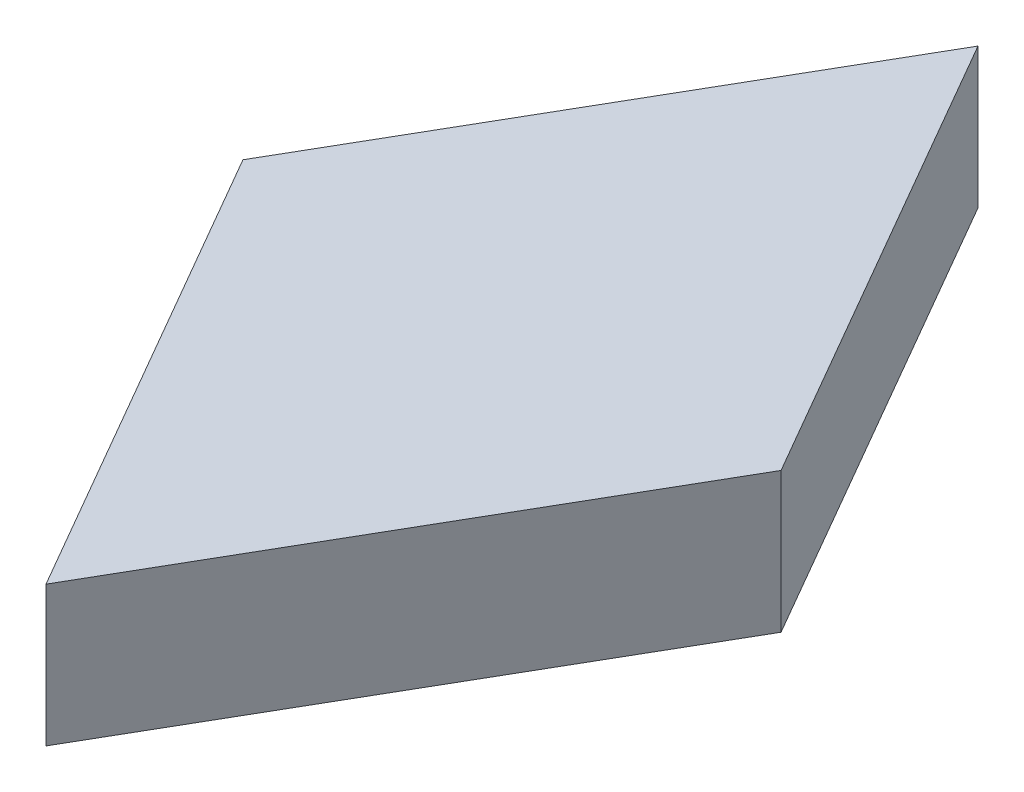
ISO-10303-21;
HEADER;
FILE_DESCRIPTION(('STEP AP214'),'2;1');
FILE_NAME('part.step','',(''),(''),'','','');
FILE_SCHEMA(('AUTOMOTIVE_DESIGN { 1 0 10303 214 1 1 1 1 }'));
ENDSEC;
DATA;
#1=APPLICATION_CONTEXT('core data for automotive mechanical design processes');
#2=APPLICATION_PROTOCOL_DEFINITION('international standard','automotive_design',2000,#1);
#3=PRODUCT_CONTEXT('',#1,'mechanical');
#4=PRODUCT('Part','Part','',(#3));
#5=PRODUCT_RELATED_PRODUCT_CATEGORY('part','',(#4));
#6=PRODUCT_DEFINITION_FORMATION('','',#4);
#7=PRODUCT_DEFINITION_CONTEXT('part definition',#1,'design');
#8=PRODUCT_DEFINITION('design','',#6,#7);
#9=PRODUCT_DEFINITION_SHAPE('','',#8);
#10=(LENGTH_UNIT() NAMED_UNIT(*) SI_UNIT(.MILLI.,.METRE.));
#11=(NAMED_UNIT(*) PLANE_ANGLE_UNIT() SI_UNIT($,.RADIAN.));
#12=(NAMED_UNIT(*) SI_UNIT($,.STERADIAN.) SOLID_ANGLE_UNIT());
#13=UNCERTAINTY_MEASURE_WITH_UNIT(LENGTH_MEASURE(1.E-05),#10,'distance_accuracy_value','');
#14=(GEOMETRIC_REPRESENTATION_CONTEXT(3) GLOBAL_UNCERTAINTY_ASSIGNED_CONTEXT((#13)) GLOBAL_UNIT_ASSIGNED_CONTEXT((#10,
#11,#12)) REPRESENTATION_CONTEXT('',''));
#15=CARTESIAN_POINT('',(0.,0.,0.));
#16=DIRECTION('',(0.,0.,1.));
#17=DIRECTION('',(1.,0.,0.));
#18=AXIS2_PLACEMENT_3D('',#15,#16,#17);
#19=CARTESIAN_POINT('',(0.,2.,6.65107510106452));
#20=DIRECTION('',(-0.866025403784438,0.,-0.5));
#21=DIRECTION('',(-0.5,0.,0.866025403784438));
#22=AXIS2_PLACEMENT_3D('',#19,#20,#21);
#23=PLANE('',#22);
#24=DIRECTION('',(0.5,0.,-0.866025403784438));
#25=VECTOR('',#24,1.);
#26=CARTESIAN_POINT('',(0.,0.,6.65107510106452));
#27=LINE('',#26,#25);
#28=CARTESIAN_POINT('',(0.,0.,6.65107510106452));
#29=VERTEX_POINT('',#28);
#30=CARTESIAN_POINT('',(3.83999999999999,0.,0.));
#31=VERTEX_POINT('',#30);
#32=EDGE_CURVE('E107',#29,#31,#27,.T.);
#33=ORIENTED_EDGE('',*,*,#32,.T.);
#34=DIRECTION('',(0.,-1.,0.));
#35=VECTOR('',#34,1.);
#36=CARTESIAN_POINT('',(3.83999999999999,2.,0.));
#37=LINE('',#36,#35);
#38=CARTESIAN_POINT('',(3.83999999999999,2.,0.));
#39=VERTEX_POINT('',#38);
#40=EDGE_CURVE('E11',#39,#31,#37,.T.);
#41=ORIENTED_EDGE('',*,*,#40,.F.);
#42=DIRECTION('',(0.5,0.,-0.866025403784438));
#43=VECTOR('',#42,1.);
#44=CARTESIAN_POINT('',(0.,2.,6.65107510106452));
#45=LINE('',#44,#43);
#46=CARTESIAN_POINT('',(0.,2.,6.65107510106452));
#47=VERTEX_POINT('',#46);
#48=EDGE_CURVE('E92',#47,#39,#45,.T.);
#49=ORIENTED_EDGE('',*,*,#48,.F.);
#50=DIRECTION('',(0.,-1.,0.));
#51=VECTOR('',#50,1.);
#52=CARTESIAN_POINT('',(0.,2.,6.65107510106452));
#53=LINE('',#52,#51);
#54=EDGE_CURVE('E103',#47,#29,#53,.T.);
#55=ORIENTED_EDGE('',*,*,#54,.T.);
#56=EDGE_LOOP('',(#33,#41,#49,#55));
#57=FACE_BOUND('',#56,.T.);
#58=ADVANCED_FACE('F40',(#57),#23,.F.);
#59=CARTESIAN_POINT('',(3.83999999999999,2.,0.));
#60=DIRECTION('',(-0.866025403784438,0.,0.500000000000001));
#61=DIRECTION('',(0.500000000000001,0.,0.866025403784438));
#62=AXIS2_PLACEMENT_3D('',#59,#60,#61);
#63=PLANE('',#62);
#64=DIRECTION('',(-0.500000000000001,0.,-0.866025403784438));
#65=VECTOR('',#64,1.);
#66=CARTESIAN_POINT('',(3.83999999999999,0.,0.));
#67=LINE('',#66,#65);
#68=CARTESIAN_POINT('',(0.,0.,-6.65107510106452));
#69=VERTEX_POINT('',#68);
#70=EDGE_CURVE('E97',#31,#69,#67,.T.);
#71=ORIENTED_EDGE('',*,*,#70,.T.);
#72=DIRECTION('',(0.,-1.,0.));
#73=VECTOR('',#72,1.);
#74=CARTESIAN_POINT('',(0.,2.,-6.65107510106452));
#75=LINE('',#74,#73);
#76=CARTESIAN_POINT('',(0.,2.,-6.65107510106452));
#77=VERTEX_POINT('',#76);
#78=EDGE_CURVE('E48',#77,#69,#75,.T.);
#79=ORIENTED_EDGE('',*,*,#78,.F.);
#80=DIRECTION('',(-0.500000000000001,0.,-0.866025403784438));
#81=VECTOR('',#80,1.);
#82=CARTESIAN_POINT('',(3.83999999999999,2.,0.));
#83=LINE('',#82,#81);
#84=EDGE_CURVE('E86',#39,#77,#83,.T.);
#85=ORIENTED_EDGE('',*,*,#84,.F.);
#86=ORIENTED_EDGE('',*,*,#40,.T.);
#87=EDGE_LOOP('',(#71,#79,#85,#86));
#88=FACE_BOUND('',#87,.T.);
#89=ADVANCED_FACE('F96',(#88),#63,.F.);
#90=CARTESIAN_POINT('',(0.,2.,-6.65107510106452));
#91=DIRECTION('',(0.866025403784442,0.,0.499999999999995));
#92=DIRECTION('',(0.499999999999995,0.,-0.866025403784442));
#93=AXIS2_PLACEMENT_3D('',#90,#91,#92);
#94=PLANE('',#93);
#95=DIRECTION('',(-0.499999999999995,0.,0.866025403784442));
#96=VECTOR('',#95,1.);
#97=CARTESIAN_POINT('',(0.,0.,-6.65107510106452));
#98=LINE('',#97,#96);
#99=CARTESIAN_POINT('',(-3.83999999999999,0.,0.));
#100=VERTEX_POINT('',#99);
#101=EDGE_CURVE('E73',#69,#100,#98,.T.);
#102=ORIENTED_EDGE('',*,*,#101,.T.);
#103=DIRECTION('',(0.,-1.,0.));
#104=VECTOR('',#103,1.);
#105=CARTESIAN_POINT('',(-3.83999999999999,2.,0.));
#106=LINE('',#105,#104);
#107=CARTESIAN_POINT('',(-3.83999999999999,2.,0.));
#108=VERTEX_POINT('',#107);
#109=EDGE_CURVE('E99',#108,#100,#106,.T.);
#110=ORIENTED_EDGE('',*,*,#109,.F.);
#111=DIRECTION('',(-0.499999999999995,0.,0.866025403784442));
#112=VECTOR('',#111,1.);
#113=CARTESIAN_POINT('',(0.,2.,-6.65107510106452));
#114=LINE('',#113,#112);
#115=EDGE_CURVE('E90',#77,#108,#114,.T.);
#116=ORIENTED_EDGE('',*,*,#115,.F.);
#117=ORIENTED_EDGE('',*,*,#78,.T.);
#118=EDGE_LOOP('',(#102,#110,#116,#117));
#119=FACE_BOUND('',#118,.T.);
#120=ADVANCED_FACE('F100',(#119),#94,.F.);
#121=CARTESIAN_POINT('',(-3.83999999999999,2.,0.));
#122=DIRECTION('',(0.866025403784442,0.,-0.499999999999994));
#123=DIRECTION('',(-0.499999999999994,0.,-0.866025403784442));
#124=AXIS2_PLACEMENT_3D('',#121,#122,#123);
#125=PLANE('',#124);
#126=DIRECTION('',(0.499999999999994,0.,0.866025403784442));
#127=VECTOR('',#126,1.);
#128=CARTESIAN_POINT('',(-3.83999999999999,0.,0.));
#129=LINE('',#128,#127);
#130=EDGE_CURVE('E79',#100,#29,#129,.T.);
#131=ORIENTED_EDGE('',*,*,#130,.T.);
#132=ORIENTED_EDGE('',*,*,#54,.F.);
#133=DIRECTION('',(0.499999999999994,0.,0.866025403784442));
#134=VECTOR('',#133,1.);
#135=CARTESIAN_POINT('',(-3.83999999999999,2.,0.));
#136=LINE('',#135,#134);
#137=EDGE_CURVE('E56',#108,#47,#136,.T.);
#138=ORIENTED_EDGE('',*,*,#137,.F.);
#139=ORIENTED_EDGE('',*,*,#109,.T.);
#140=EDGE_LOOP('',(#131,#132,#138,#139));
#141=FACE_BOUND('',#140,.T.);
#142=ADVANCED_FACE('F115',(#141),#125,.F.);
#143=CARTESIAN_POINT('',(0.,2.,0.));
#144=DIRECTION('',(0.,1.,0.));
#145=DIRECTION('',(0.,0.,1.));
#146=AXIS2_PLACEMENT_3D('',#143,#144,#145);
#147=PLANE('',#146);
#148=ORIENTED_EDGE('',*,*,#48,.T.);
#149=ORIENTED_EDGE('',*,*,#84,.T.);
#150=ORIENTED_EDGE('',*,*,#115,.T.);
#151=ORIENTED_EDGE('',*,*,#137,.T.);
#152=EDGE_LOOP('',(#148,#149,#150,#151));
#153=FACE_BOUND('',#152,.T.);
#154=ADVANCED_FACE('F88',(#153),#147,.T.);
#155=CARTESIAN_POINT('',(0.,0.,0.));
#156=DIRECTION('',(0.,1.,0.));
#157=DIRECTION('',(0.,0.,1.));
#158=AXIS2_PLACEMENT_3D('',#155,#156,#157);
#159=PLANE('',#158);
#160=CARTESIAN_POINT('',(0.,0.,0.));
#161=DIRECTION('',(0.,-1.,0.));
#162=DIRECTION('',(0.,0.,-1.));
#163=AXIS2_PLACEMENT_3D('',#160,#161,#162);
#164=CIRCLE('',#163,1.5);
#165=CARTESIAN_POINT('',(0.,0.,-1.5));
#166=VERTEX_POINT('',#165);
#167=EDGE_CURVE('E121',#166,#166,#164,.T.);
#168=ORIENTED_EDGE('',*,*,#167,.F.);
#169=EDGE_LOOP('',(#168));
#170=FACE_BOUND('',#169,.T.);
#171=ORIENTED_EDGE('',*,*,#32,.F.);
#172=ORIENTED_EDGE('',*,*,#130,.F.);
#173=ORIENTED_EDGE('',*,*,#101,.F.);
#174=ORIENTED_EDGE('',*,*,#70,.F.);
#175=EDGE_LOOP('',(#171,#172,#173,#174));
#176=FACE_BOUND('',#175,.T.);
#177=ADVANCED_FACE('F118',(#170,#176),#159,.F.);
#178=CARTESIAN_POINT('',(0.,1.,0.));
#179=DIRECTION('',(0.,-1.,0.));
#180=DIRECTION('',(0.,0.,-1.));
#181=AXIS2_PLACEMENT_3D('',#178,#179,#180);
#182=CYLINDRICAL_SURFACE('',#181,1.5);
#183=CARTESIAN_POINT('',(0.,1.,0.));
#184=DIRECTION('',(0.,-1.,0.));
#185=DIRECTION('',(0.,0.,-1.));
#186=AXIS2_PLACEMENT_3D('',#183,#184,#185);
#187=CIRCLE('',#186,1.5);
#188=CARTESIAN_POINT('',(0.,1.,-1.5));
#189=VERTEX_POINT('',#188);
#190=EDGE_CURVE('E110',#189,#189,#187,.T.);
#191=ORIENTED_EDGE('',*,*,#190,.F.);
#192=EDGE_LOOP('',(#191));
#193=FACE_BOUND('',#192,.T.);
#194=ORIENTED_EDGE('',*,*,#167,.T.);
#195=EDGE_LOOP('',(#194));
#196=FACE_BOUND('',#195,.T.);
#197=ADVANCED_FACE('F129',(#193,#196),#182,.F.);
#198=CARTESIAN_POINT('',(0.,1.,0.));
#199=DIRECTION('',(0.,-1.,0.));
#200=DIRECTION('',(0.,0.,-1.));
#201=AXIS2_PLACEMENT_3D('',#198,#199,#200);
#202=PLANE('',#201);
#203=ORIENTED_EDGE('',*,*,#190,.T.);
#204=EDGE_LOOP('',(#203));
#205=FACE_BOUND('',#204,.T.);
#206=ADVANCED_FACE('F127',(#205),#202,.T.);
#207=CLOSED_SHELL('',(#58,#89,#120,#142,#154,#177,#197,#206));
#208=MANIFOLD_SOLID_BREP('B2',#207);
#209=ADVANCED_BREP_SHAPE_REPRESENTATION('',(#18,#208),#14);
#210=SHAPE_DEFINITION_REPRESENTATION(#9,#209);
ENDSEC;
END-ISO-10303-21;
